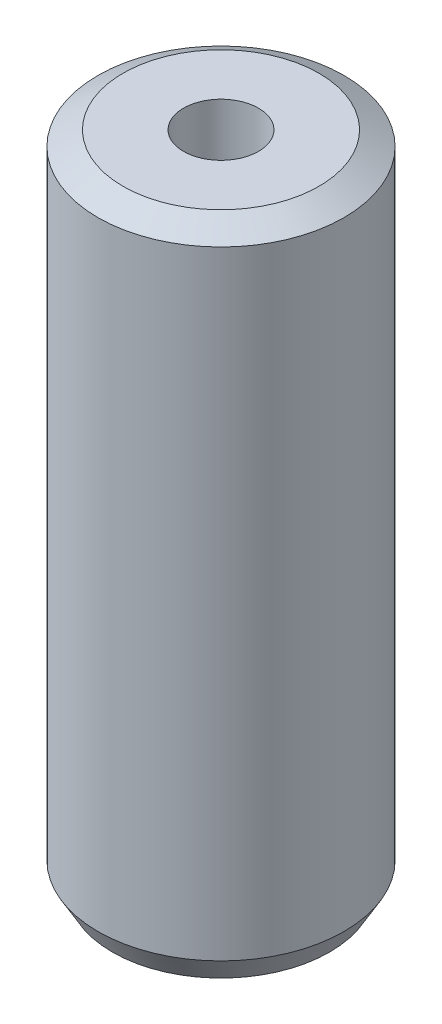
ISO-10303-21;
HEADER;
FILE_DESCRIPTION(('STEP AP214'),'2;1');
FILE_NAME('part.step','',(''),(''),'','','');
FILE_SCHEMA(('AUTOMOTIVE_DESIGN { 1 0 10303 214 1 1 1 1 }'));
ENDSEC;
DATA;
#1=APPLICATION_CONTEXT('core data for automotive mechanical design processes');
#2=APPLICATION_PROTOCOL_DEFINITION('international standard','automotive_design',2000,#1);
#3=PRODUCT_CONTEXT('',#1,'mechanical');
#4=PRODUCT('Part','Part','',(#3));
#5=PRODUCT_RELATED_PRODUCT_CATEGORY('part','',(#4));
#6=PRODUCT_DEFINITION_FORMATION('','',#4);
#7=PRODUCT_DEFINITION_CONTEXT('part definition',#1,'design');
#8=PRODUCT_DEFINITION('design','',#6,#7);
#9=PRODUCT_DEFINITION_SHAPE('','',#8);
#10=(LENGTH_UNIT() NAMED_UNIT(*) SI_UNIT(.MILLI.,.METRE.));
#11=(NAMED_UNIT(*) PLANE_ANGLE_UNIT() SI_UNIT($,.RADIAN.));
#12=(NAMED_UNIT(*) SI_UNIT($,.STERADIAN.) SOLID_ANGLE_UNIT());
#13=UNCERTAINTY_MEASURE_WITH_UNIT(LENGTH_MEASURE(1.E-05),#10,'distance_accuracy_value','');
#14=(GEOMETRIC_REPRESENTATION_CONTEXT(3) GLOBAL_UNCERTAINTY_ASSIGNED_CONTEXT((#13)) GLOBAL_UNIT_ASSIGNED_CONTEXT((#10,
#11,#12)) REPRESENTATION_CONTEXT('',''));
#15=CARTESIAN_POINT('',(0.,0.,0.));
#16=DIRECTION('',(0.,0.,1.));
#17=DIRECTION('',(1.,0.,0.));
#18=AXIS2_PLACEMENT_3D('',#15,#16,#17);
#19=CARTESIAN_POINT('',(0.,53.4445038974857,0.));
#20=DIRECTION('',(0.,-1.,0.));
#21=DIRECTION('',(0.,0.,-1.));
#22=AXIS2_PLACEMENT_3D('',#19,#20,#21);
#23=CYLINDRICAL_SURFACE('',#22,10.);
#24=CARTESIAN_POINT('',(0.,52.2665922035745,0.));
#25=DIRECTION('',(0.,1.,0.));
#26=DIRECTION('',(0.,0.,1.));
#27=AXIS2_PLACEMENT_3D('',#24,#25,#26);
#28=CIRCLE('',#27,10.);
#29=CARTESIAN_POINT('',(0.,52.2665922035745,-10.));
#30=VERTEX_POINT('',#29);
#31=EDGE_CURVE('E50',#30,#30,#28,.F.);
#32=CARTESIAN_POINT('',(0.,2.040202900684,0.));
#33=DIRECTION('',(0.,1.,0.));
#34=DIRECTION('',(0.,0.,1.));
#35=AXIS2_PLACEMENT_3D('',#32,#33,#34);
#36=CIRCLE('',#35,10.);
#37=CARTESIAN_POINT('',(0.,2.040202900684,-10.));
#38=VERTEX_POINT('',#37);
#39=EDGE_CURVE('E51',#38,#38,#36,.T.);
#40=CARTESIAN_POINT('',(0.,52.2665922035745,-10.));
#41=CARTESIAN_POINT('',(0.,51.743400648336,-10.));
#42=CARTESIAN_POINT('',(0.,51.2202090930976,-10.));
#43=CARTESIAN_POINT('',(0.,50.1738259826207,-10.));
#44=CARTESIAN_POINT('',(0.,49.6506344273823,-10.));
#45=CARTESIAN_POINT('',(0.,48.6042513169054,-10.));
#46=CARTESIAN_POINT('',(0.,48.0810597616669,-10.));
#47=CARTESIAN_POINT('',(0.,47.03467665119,-10.));
#48=CARTESIAN_POINT('',(0.,46.5114850959516,-10.));
#49=CARTESIAN_POINT('',(0.,45.4651019854747,-10.));
#50=CARTESIAN_POINT('',(0.,44.9419104302363,-10.));
#51=CARTESIAN_POINT('',(0.,43.8955273197594,-10.));
#52=CARTESIAN_POINT('',(0.,43.3723357645209,-10.));
#53=CARTESIAN_POINT('',(0.,42.3259526540441,-10.));
#54=CARTESIAN_POINT('',(0.,41.8027610988056,-10.));
#55=CARTESIAN_POINT('',(0.,40.7563779883287,-10.));
#56=CARTESIAN_POINT('',(0.,40.2331864330903,-10.));
#57=CARTESIAN_POINT('',(0.,39.1868033226134,-10.));
#58=CARTESIAN_POINT('',(0.,38.663611767375,-10.));
#59=CARTESIAN_POINT('',(0.,37.6172286568981,-10.));
#60=CARTESIAN_POINT('',(0.,37.0940371016596,-10.));
#61=CARTESIAN_POINT('',(0.,36.0476539911828,-10.));
#62=CARTESIAN_POINT('',(0.,35.5244624359443,-10.));
#63=CARTESIAN_POINT('',(0.,34.4780793254674,-10.));
#64=CARTESIAN_POINT('',(0.,33.954887770229,-10.));
#65=CARTESIAN_POINT('',(0.,32.9085046597521,-10.));
#66=CARTESIAN_POINT('',(0.,32.3853131045137,-10.));
#67=CARTESIAN_POINT('',(0.,31.3389299940368,-10.));
#68=CARTESIAN_POINT('',(0.,30.8157384387983,-10.));
#69=CARTESIAN_POINT('',(0.,29.7693553283214,-10.));
#70=CARTESIAN_POINT('',(0.,29.246163773083,-10.));
#71=CARTESIAN_POINT('',(0.,28.1997806626061,-10.));
#72=CARTESIAN_POINT('',(0.,27.6765891073677,-10.));
#73=CARTESIAN_POINT('',(0.,26.6302059968908,-10.));
#74=CARTESIAN_POINT('',(0.,26.1070144416523,-10.));
#75=CARTESIAN_POINT('',(0.,25.0606313311755,-10.));
#76=CARTESIAN_POINT('',(0.,24.537439775937,-10.));
#77=CARTESIAN_POINT('',(0.,23.4910566654601,-10.));
#78=CARTESIAN_POINT('',(0.,22.9678651102217,-10.));
#79=CARTESIAN_POINT('',(0.,21.9214819997448,-10.));
#80=CARTESIAN_POINT('',(0.,21.3982904445064,-10.));
#81=CARTESIAN_POINT('',(0.,20.3519073340295,-10.));
#82=CARTESIAN_POINT('',(0.,19.828715778791,-10.));
#83=CARTESIAN_POINT('',(0.,18.7823326683142,-10.));
#84=CARTESIAN_POINT('',(0.,18.2591411130757,-10.));
#85=CARTESIAN_POINT('',(0.,17.2127580025988,-10.));
#86=CARTESIAN_POINT('',(0.,16.6895664473604,-10.));
#87=CARTESIAN_POINT('',(0.,15.6431833368835,-10.));
#88=CARTESIAN_POINT('',(0.,15.1199917816451,-10.));
#89=CARTESIAN_POINT('',(0.,14.0736086711682,-10.));
#90=CARTESIAN_POINT('',(0.,13.5504171159297,-10.));
#91=CARTESIAN_POINT('',(0.,12.5040340054528,-10.));
#92=CARTESIAN_POINT('',(0.,11.9808424502144,-10.));
#93=CARTESIAN_POINT('',(0.,10.9344593397375,-10.));
#94=CARTESIAN_POINT('',(0.,10.4112677844991,-10.));
#95=CARTESIAN_POINT('',(0.,9.36488467402219,-10.));
#96=CARTESIAN_POINT('',(0.,8.84169311878375,-10.));
#97=CARTESIAN_POINT('',(0.,7.79531000830686,-10.));
#98=CARTESIAN_POINT('',(0.,7.27211845306842,-10.));
#99=CARTESIAN_POINT('',(0.,6.22573534259154,-10.));
#100=CARTESIAN_POINT('',(0.,5.70254378735309,-10.));
#101=CARTESIAN_POINT('',(0.,4.65616067687621,-10.));
#102=CARTESIAN_POINT('',(0.,4.13296912163777,-10.));
#103=CARTESIAN_POINT('',(0.,3.08658601116088,-10.));
#104=CARTESIAN_POINT('',(0.,2.56339445592244,-10.));
#105=CARTESIAN_POINT('',(0.,2.040202900684,-10.));
#106=B_SPLINE_CURVE_WITH_KNOTS('',3,(#40,#41,#42,#43,#44,#45,#46,#47,#48,#49,#50,#51,#52,#53,
#54,#55,#56,#57,#58,#59,#60,#61,#62,#63,#64,#65,#66,#67,#68,#69,#70,#71,#72,#73,#74,#75,#76,#77,
#78,#79,#80,#81,#82,#83,#84,#85,#86,#87,#88,#89,#90,#91,#92,#93,#94,#95,#96,#97,#98,#99,#100,
#101,#102,#103,#104,#105),.UNSPECIFIED.,.F.,.F.,(4,2,2,2,2,2,2,2,2,2,2,2,2,2,2,2,2,2,2,2,2,2,2,
2,2,2,2,2,2,2,2,2,4),(0.,1.56957466571532,3.13914933143065,4.70872399714597,6.2782986628613,
7.84787332857663,9.41744799429196,10.9870226600073,12.5565973257226,14.1261719914379,
15.6957466571533,17.2653213228686,18.8348959885839,20.4044706542992,21.9740453200146,
23.5436199857299,25.1131946514452,26.6827693171606,28.2523439828759,29.8219186485912,
31.3914933143065,32.9610679800219,34.5306426457372,36.1002173114525,37.6697919771678,
39.2393666428832,40.8089413085985,42.3785159743138,43.9480906400292,45.5176653057445,
47.0872399714598,48.6568146371751,50.2263893028905),.UNSPECIFIED.);
#107=EDGE_CURVE('BSEAM39',#30,#38,#106,.T.);
#108=ORIENTED_EDGE('',*,*,#31,.T.);
#109=ORIENTED_EDGE('',*,*,#39,.T.);
#110=ORIENTED_EDGE('',*,*,#107,.T.);
#111=ORIENTED_EDGE('',*,*,#107,.F.);
#112=EDGE_LOOP('',(#108,#110,#109,#111));
#113=FACE_BOUND('',#112,.T.);
#114=ADVANCED_FACE('F39',(#113),#23,.T.);
#115=CARTESIAN_POINT('',(0.,53.4445038974857,0.));
#116=DIRECTION('',(0.,1.,0.));
#117=DIRECTION('',(0.,0.,1.));
#118=AXIS2_PLACEMENT_3D('',#115,#116,#117);
#119=PLANE('',#118);
#120=CARTESIAN_POINT('',(0.,53.4445038974857,0.));
#121=DIRECTION('',(0.,1.,0.));
#122=DIRECTION('',(0.,0.,1.));
#123=AXIS2_PLACEMENT_3D('',#120,#121,#122);
#124=CIRCLE('',#123,7.95979709931615);
#125=CARTESIAN_POINT('',(0.,53.4445038974857,7.95979709931615));
#126=VERTEX_POINT('',#125);
#127=EDGE_CURVE('E54',#126,#126,#124,.T.);
#128=ORIENTED_EDGE('',*,*,#127,.T.);
#129=EDGE_LOOP('',(#128));
#130=FACE_BOUND('',#129,.T.);
#131=CARTESIAN_POINT('',(0.,53.4445038974857,0.));
#132=DIRECTION('',(0.,1.,0.));
#133=DIRECTION('',(0.,0.,1.));
#134=AXIS2_PLACEMENT_3D('',#131,#132,#133);
#135=CIRCLE('',#134,3.04478551453195);
#136=CARTESIAN_POINT('',(0.,53.4445038974857,-3.04478551453195));
#137=VERTEX_POINT('',#136);
#138=EDGE_CURVE('E58',#137,#137,#135,.T.);
#139=ORIENTED_EDGE('',*,*,#138,.F.);
#140=EDGE_LOOP('',(#139));
#141=FACE_BOUND('',#140,.T.);
#142=ADVANCED_FACE('F69',(#130,#141),#119,.T.);
#143=CARTESIAN_POINT('',(0.,0.,0.));
#144=DIRECTION('',(0.,1.,0.));
#145=DIRECTION('',(0.,0.,1.));
#146=AXIS2_PLACEMENT_3D('',#143,#144,#145);
#147=PLANE('',#146);
#148=CARTESIAN_POINT('',(0.,0.,0.));
#149=DIRECTION('',(0.,1.,0.));
#150=DIRECTION('',(0.,0.,1.));
#151=AXIS2_PLACEMENT_3D('',#148,#149,#150);
#152=CIRCLE('',#151,8.82208830608863);
#153=CARTESIAN_POINT('',(0.,0.,8.82208830608863));
#154=VERTEX_POINT('',#153);
#155=EDGE_CURVE('E10',#154,#154,#152,.F.);
#156=ORIENTED_EDGE('',*,*,#155,.T.);
#157=EDGE_LOOP('',(#156));
#158=FACE_BOUND('',#157,.T.);
#159=CARTESIAN_POINT('',(0.,0.,0.));
#160=DIRECTION('',(0.,1.,0.));
#161=DIRECTION('',(0.,0.,1.));
#162=AXIS2_PLACEMENT_3D('',#159,#160,#161);
#163=CIRCLE('',#162,3.04478551453195);
#164=CARTESIAN_POINT('',(0.,0.,-3.04478551453195));
#165=VERTEX_POINT('',#164);
#166=EDGE_CURVE('E63',#165,#165,#163,.T.);
#167=ORIENTED_EDGE('',*,*,#166,.T.);
#168=EDGE_LOOP('',(#167));
#169=FACE_BOUND('',#168,.T.);
#170=ADVANCED_FACE('F75',(#158,#169),#147,.F.);
#171=CARTESIAN_POINT('',(0.,53.4445038974857,0.));
#172=DIRECTION('',(0.,-1.,0.));
#173=DIRECTION('',(0.,0.,-1.));
#174=AXIS2_PLACEMENT_3D('',#171,#172,#173);
#175=CYLINDRICAL_SURFACE('',#174,3.04478551453195);
#176=CARTESIAN_POINT('',(0.,53.4445038974857,-3.04478551453195));
#177=CARTESIAN_POINT('',(0.,52.8877903152203,-3.04478551453195));
#178=CARTESIAN_POINT('',(0.,52.3310767329548,-3.04478551453195));
#179=CARTESIAN_POINT('',(0.,51.2176495684238,-3.04478551453195));
#180=CARTESIAN_POINT('',(0.,50.6609359861584,-3.04478551453195));
#181=CARTESIAN_POINT('',(0.,49.5475088216274,-3.04478551453195));
#182=CARTESIAN_POINT('',(0.,48.9907952393619,-3.04478551453195));
#183=CARTESIAN_POINT('',(0.,47.877368074831,-3.04478551453195));
#184=CARTESIAN_POINT('',(0.,47.3206544925655,-3.04478551453195));
#185=CARTESIAN_POINT('',(0.,46.2072273280345,-3.04478551453195));
#186=CARTESIAN_POINT('',(0.,45.6505137457691,-3.04478551453195));
#187=CARTESIAN_POINT('',(0.,44.5370865812381,-3.04478551453195));
#188=CARTESIAN_POINT('',(0.,43.9803729989726,-3.04478551453195));
#189=CARTESIAN_POINT('',(0.,42.8669458344417,-3.04478551453195));
#190=CARTESIAN_POINT('',(0.,42.3102322521762,-3.04478551453195));
#191=CARTESIAN_POINT('',(0.,41.1968050876453,-3.04478551453195));
#192=CARTESIAN_POINT('',(0.,40.6400915053798,-3.04478551453195));
#193=CARTESIAN_POINT('',(0.,39.5266643408488,-3.04478551453195));
#194=CARTESIAN_POINT('',(0.,38.9699507585834,-3.04478551453195));
#195=CARTESIAN_POINT('',(0.,37.8565235940524,-3.04478551453195));
#196=CARTESIAN_POINT('',(0.,37.2998100117869,-3.04478551453195));
#197=CARTESIAN_POINT('',(0.,36.186382847256,-3.04478551453195));
#198=CARTESIAN_POINT('',(0.,35.6296692649905,-3.04478551453195));
#199=CARTESIAN_POINT('',(0.,34.5162421004595,-3.04478551453195));
#200=CARTESIAN_POINT('',(0.,33.9595285181941,-3.04478551453195));
#201=CARTESIAN_POINT('',(0.,32.8461013536631,-3.04478551453195));
#202=CARTESIAN_POINT('',(0.,32.2893877713976,-3.04478551453195));
#203=CARTESIAN_POINT('',(0.,31.1759606068667,-3.04478551453195));
#204=CARTESIAN_POINT('',(0.,30.6192470246012,-3.04478551453195));
#205=CARTESIAN_POINT('',(0.,29.5058198600703,-3.04478551453195));
#206=CARTESIAN_POINT('',(0.,28.9491062778048,-3.04478551453195));
#207=CARTESIAN_POINT('',(0.,27.8356791132738,-3.04478551453195));
#208=CARTESIAN_POINT('',(0.,27.2789655310083,-3.04478551453195));
#209=CARTESIAN_POINT('',(0.,26.1655383664774,-3.04478551453195));
#210=CARTESIAN_POINT('',(0.,25.6088247842119,-3.04478551453195));
#211=CARTESIAN_POINT('',(0.,24.495397619681,-3.04478551453195));
#212=CARTESIAN_POINT('',(0.,23.9386840374155,-3.04478551453195));
#213=CARTESIAN_POINT('',(0.,22.8252568728845,-3.04478551453195));
#214=CARTESIAN_POINT('',(0.,22.2685432906191,-3.04478551453195));
#215=CARTESIAN_POINT('',(0.,21.1551161260881,-3.04478551453195));
#216=CARTESIAN_POINT('',(0.,20.5984025438226,-3.04478551453195));
#217=CARTESIAN_POINT('',(0.,19.4849753792917,-3.04478551453195));
#218=CARTESIAN_POINT('',(0.,18.9282617970262,-3.04478551453195));
#219=CARTESIAN_POINT('',(0.,17.8148346324952,-3.04478551453195));
#220=CARTESIAN_POINT('',(0.,17.2581210502298,-3.04478551453195));
#221=CARTESIAN_POINT('',(0.,16.1446938856988,-3.04478551453195));
#222=CARTESIAN_POINT('',(0.,15.5879803034333,-3.04478551453195));
#223=CARTESIAN_POINT('',(0.,14.4745531389024,-3.04478551453195));
#224=CARTESIAN_POINT('',(0.,13.9178395566369,-3.04478551453195));
#225=CARTESIAN_POINT('',(0.,12.804412392106,-3.04478551453195));
#226=CARTESIAN_POINT('',(0.,12.2476988098405,-3.04478551453195));
#227=CARTESIAN_POINT('',(0.,11.1342716453095,-3.04478551453195));
#228=CARTESIAN_POINT('',(0.,10.577558063044,-3.04478551453195));
#229=CARTESIAN_POINT('',(0.,9.46413089851309,-3.04478551453195));
#230=CARTESIAN_POINT('',(0.,8.90741731624762,-3.04478551453195));
#231=CARTESIAN_POINT('',(0.,7.79399015171666,-3.04478551453195));
#232=CARTESIAN_POINT('',(0.,7.23727656945119,-3.04478551453195));
#233=CARTESIAN_POINT('',(0.,6.12384940492023,-3.04478551453195));
#234=CARTESIAN_POINT('',(0.,5.56713582265476,-3.04478551453195));
#235=CARTESIAN_POINT('',(0.,4.45370865812381,-3.04478551453195));
#236=CARTESIAN_POINT('',(0.,3.89699507585833,-3.04478551453195));
#237=CARTESIAN_POINT('',(0.,2.78356791132738,-3.04478551453195));
#238=CARTESIAN_POINT('',(0.,2.2268543290619,-3.04478551453195));
#239=CARTESIAN_POINT('',(0.,1.11342716453095,-3.04478551453195));
#240=CARTESIAN_POINT('',(0.,0.55671358226547,-3.04478551453195));
#241=CARTESIAN_POINT('',(0.,0.,-3.04478551453195));
#242=B_SPLINE_CURVE_WITH_KNOTS('',3,(#176,#177,#178,#179,#180,#181,#182,#183,#184,#185,#186,
#187,#188,#189,#190,#191,#192,#193,#194,#195,#196,#197,#198,#199,#200,#201,#202,#203,#204,#205,
#206,#207,#208,#209,#210,#211,#212,#213,#214,#215,#216,#217,#218,#219,#220,#221,#222,#223,#224,
#225,#226,#227,#228,#229,#230,#231,#232,#233,#234,#235,#236,#237,#238,#239,#240,#241),
.UNSPECIFIED.,.F.,.F.,(4,2,2,2,2,2,2,2,2,2,2,2,2,2,2,2,2,2,2,2,2,2,2,2,2,2,2,2,2,2,2,2,4),(0.,
1.67014074679642,3.34028149359285,5.01042224038929,6.68056298718572,8.35070373398215,
10.0208444807786,11.690985227575,13.3611259743714,15.0312667211679,16.7014074679643,
18.3715482147607,20.0416889615571,21.7118297083536,23.38197045515,25.0521112019464,
26.7222519487429,28.3923926955393,30.0625334423357,31.7326741891322,33.4028149359286,
35.072955682725,36.7430964295215,38.4132371763179,40.0833779231143,41.7535186699107,
43.4236594167072,45.0938001635036,46.7639409103,48.4340816570964,50.1042224038929,
51.7743631506893,53.4445038974857),.UNSPECIFIED.);
#243=EDGE_CURVE('BSEAM70',#137,#165,#242,.T.);
#244=ORIENTED_EDGE('',*,*,#138,.T.);
#245=ORIENTED_EDGE('',*,*,#166,.F.);
#246=ORIENTED_EDGE('',*,*,#243,.T.);
#247=ORIENTED_EDGE('',*,*,#243,.F.);
#248=EDGE_LOOP('',(#244,#246,#245,#247));
#249=FACE_BOUND('',#248,.T.);
#250=ADVANCED_FACE('F70',(#249),#175,.F.);
#251=CARTESIAN_POINT('',(0.,53.4445038974857,0.));
#252=DIRECTION('',(0.,-1.,0.));
#253=DIRECTION('',(0.,0.,-1.));
#254=AXIS2_PLACEMENT_3D('',#251,#252,#253);
#255=CONICAL_SURFACE('',#254,7.95979709931615,1.0471975511966);
#256=ORIENTED_EDGE('',*,*,#31,.F.);
#257=EDGE_LOOP('',(#256));
#258=FACE_BOUND('',#257,.T.);
#259=ORIENTED_EDGE('',*,*,#127,.F.);
#260=EDGE_LOOP('',(#259));
#261=FACE_BOUND('',#260,.T.);
#262=ADVANCED_FACE('F81',(#258,#261),#255,.T.);
#263=CARTESIAN_POINT('',(0.,2.040202900684,0.));
#264=DIRECTION('',(0.,1.,0.));
#265=DIRECTION('',(0.,0.,1.));
#266=AXIS2_PLACEMENT_3D('',#263,#264,#265);
#267=CONICAL_SURFACE('',#266,10.,0.523598775598302);
#268=ORIENTED_EDGE('',*,*,#155,.F.);
#269=EDGE_LOOP('',(#268));
#270=FACE_BOUND('',#269,.T.);
#271=ORIENTED_EDGE('',*,*,#39,.F.);
#272=EDGE_LOOP('',(#271));
#273=FACE_BOUND('',#272,.T.);
#274=ADVANCED_FACE('F45',(#270,#273),#267,.T.);
#275=CLOSED_SHELL('',(#114,#142,#170,#250,#262,#274));
#276=MANIFOLD_SOLID_BREP('B2',#275);
#277=ADVANCED_BREP_SHAPE_REPRESENTATION('',(#18,#276),#14);
#278=SHAPE_DEFINITION_REPRESENTATION(#9,#277);
ENDSEC;
END-ISO-10303-21;
